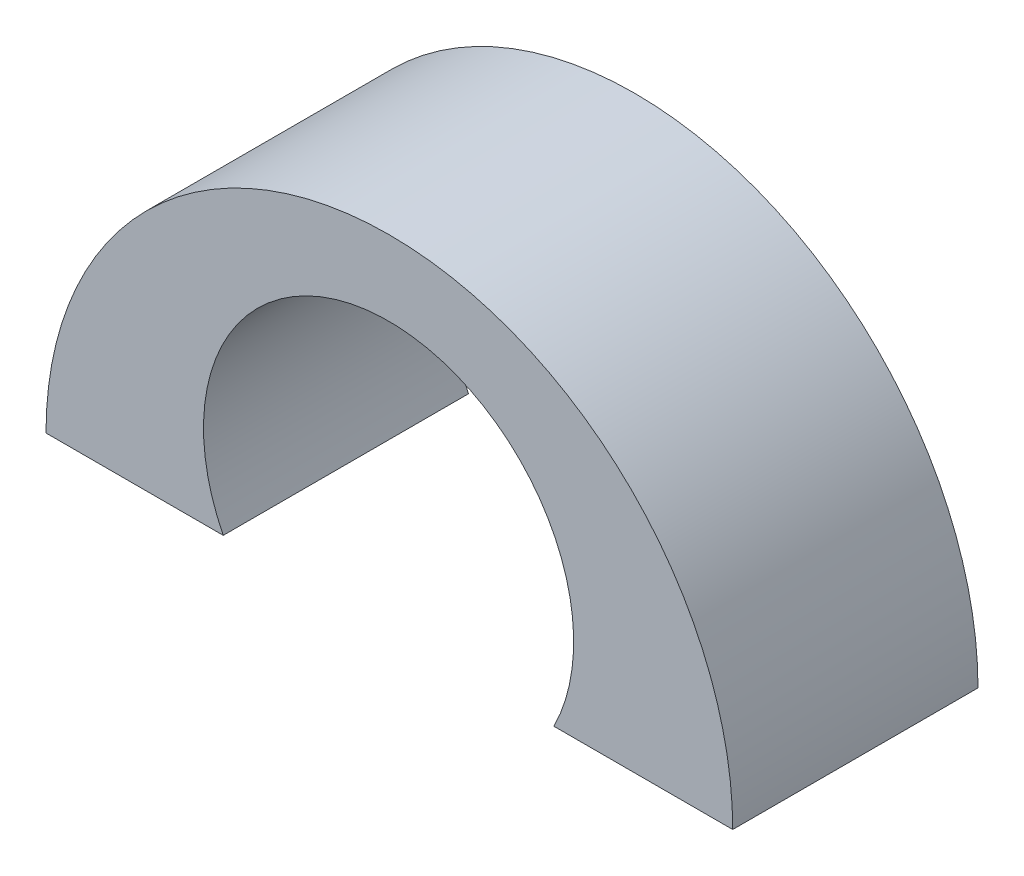
ISO-10303-21;
HEADER;
FILE_DESCRIPTION(('STEP AP214'),'2;1');
FILE_NAME('part.step','',(''),(''),'','','');
FILE_SCHEMA(('AUTOMOTIVE_DESIGN { 1 0 10303 214 1 1 1 1 }'));
ENDSEC;
DATA;
#1=APPLICATION_CONTEXT('core data for automotive mechanical design processes');
#2=APPLICATION_PROTOCOL_DEFINITION('international standard','automotive_design',2000,#1);
#3=PRODUCT_CONTEXT('',#1,'mechanical');
#4=PRODUCT('Part','Part','',(#3));
#5=PRODUCT_RELATED_PRODUCT_CATEGORY('part','',(#4));
#6=PRODUCT_DEFINITION_FORMATION('','',#4);
#7=PRODUCT_DEFINITION_CONTEXT('part definition',#1,'design');
#8=PRODUCT_DEFINITION('design','',#6,#7);
#9=PRODUCT_DEFINITION_SHAPE('','',#8);
#10=(LENGTH_UNIT() NAMED_UNIT(*) SI_UNIT(.MILLI.,.METRE.));
#11=(NAMED_UNIT(*) PLANE_ANGLE_UNIT() SI_UNIT($,.RADIAN.));
#12=(NAMED_UNIT(*) SI_UNIT($,.STERADIAN.) SOLID_ANGLE_UNIT());
#13=UNCERTAINTY_MEASURE_WITH_UNIT(LENGTH_MEASURE(1.E-05),#10,'distance_accuracy_value','');
#14=(GEOMETRIC_REPRESENTATION_CONTEXT(3) GLOBAL_UNCERTAINTY_ASSIGNED_CONTEXT((#13)) GLOBAL_UNIT_ASSIGNED_CONTEXT((#10,
#11,#12)) REPRESENTATION_CONTEXT('',''));
#15=CARTESIAN_POINT('',(0.,0.,0.));
#16=DIRECTION('',(0.,0.,1.));
#17=DIRECTION('',(1.,0.,0.));
#18=AXIS2_PLACEMENT_3D('',#15,#16,#17);
#19=CARTESIAN_POINT('',(0.,0.,5.));
#20=DIRECTION('',(0.,0.,-1.));
#21=DIRECTION('',(-1.,0.,0.));
#22=AXIS2_PLACEMENT_3D('',#19,#20,#21);
#23=CYLINDRICAL_SURFACE('',#22,7.);
#24=CARTESIAN_POINT('',(0.,0.,0.));
#25=DIRECTION('',(0.,0.,1.));
#26=DIRECTION('',(-1.,0.,0.));
#27=AXIS2_PLACEMENT_3D('',#24,#25,#26);
#28=CIRCLE('',#27,7.);
#29=CARTESIAN_POINT('',(7.,0.,0.));
#30=VERTEX_POINT('',#29);
#31=CARTESIAN_POINT('',(-7.,0.,0.));
#32=VERTEX_POINT('',#31);
#33=EDGE_CURVE('E96',#30,#32,#28,.T.);
#34=ORIENTED_EDGE('',*,*,#33,.T.);
#35=DIRECTION('',(0.,0.,-1.));
#36=VECTOR('',#35,1.);
#37=CARTESIAN_POINT('',(-7.,0.,5.));
#38=LINE('',#37,#36);
#39=CARTESIAN_POINT('',(-7.,0.,5.));
#40=VERTEX_POINT('',#39);
#41=EDGE_CURVE('E11',#40,#32,#38,.T.);
#42=ORIENTED_EDGE('',*,*,#41,.F.);
#43=CARTESIAN_POINT('',(0.,0.,5.));
#44=DIRECTION('',(0.,0.,1.));
#45=DIRECTION('',(-1.,0.,0.));
#46=AXIS2_PLACEMENT_3D('',#43,#44,#45);
#47=CIRCLE('',#46,7.);
#48=CARTESIAN_POINT('',(7.,0.,5.));
#49=VERTEX_POINT('',#48);
#50=EDGE_CURVE('E84',#49,#40,#47,.T.);
#51=ORIENTED_EDGE('',*,*,#50,.F.);
#52=DIRECTION('',(0.,0.,-1.));
#53=VECTOR('',#52,1.);
#54=CARTESIAN_POINT('',(7.,0.,5.));
#55=LINE('',#54,#53);
#56=EDGE_CURVE('E92',#49,#30,#55,.T.);
#57=ORIENTED_EDGE('',*,*,#56,.T.);
#58=EDGE_LOOP('',(#34,#42,#51,#57));
#59=FACE_BOUND('',#58,.T.);
#60=ADVANCED_FACE('F33',(#59),#23,.T.);
#61=CARTESIAN_POINT('',(-3.38648568331289,0.,5.));
#62=DIRECTION('',(0.,1.,0.));
#63=DIRECTION('',(-1.,0.,0.));
#64=AXIS2_PLACEMENT_3D('',#61,#62,#63);
#65=PLANE('',#64);
#66=DIRECTION('',(1.,0.,0.));
#67=VECTOR('',#66,1.);
#68=CARTESIAN_POINT('',(-3.38648568331289,0.,0.));
#69=LINE('',#68,#67);
#70=CARTESIAN_POINT('',(-3.38648568331289,0.,0.));
#71=VERTEX_POINT('',#70);
#72=EDGE_CURVE('E88',#32,#71,#69,.T.);
#73=ORIENTED_EDGE('',*,*,#72,.T.);
#74=DIRECTION('',(0.,0.,-1.));
#75=VECTOR('',#74,1.);
#76=CARTESIAN_POINT('',(-3.38648568331289,0.,5.));
#77=LINE('',#76,#75);
#78=CARTESIAN_POINT('',(-3.38648568331289,0.,5.));
#79=VERTEX_POINT('',#78);
#80=EDGE_CURVE('E41',#79,#71,#77,.T.);
#81=ORIENTED_EDGE('',*,*,#80,.F.);
#82=DIRECTION('',(1.,0.,0.));
#83=VECTOR('',#82,1.);
#84=CARTESIAN_POINT('',(-3.38648568331289,0.,5.));
#85=LINE('',#84,#83);
#86=EDGE_CURVE('E79',#40,#79,#85,.T.);
#87=ORIENTED_EDGE('',*,*,#86,.F.);
#88=ORIENTED_EDGE('',*,*,#41,.T.);
#89=EDGE_LOOP('',(#73,#81,#87,#88));
#90=FACE_BOUND('',#89,.T.);
#91=ADVANCED_FACE('F87',(#90),#65,.F.);
#92=CARTESIAN_POINT('',(-0.0160141943291048,1.69585177973782,5.));
#93=DIRECTION('',(0.,0.,-1.));
#94=DIRECTION('',(-1.,0.,0.));
#95=AXIS2_PLACEMENT_3D('',#92,#93,#94);
#96=CYLINDRICAL_SURFACE('',#95,3.77306126598714);
#97=CARTESIAN_POINT('',(-0.0160141943291048,1.69585177973782,0.));
#98=DIRECTION('',(0.,0.,-1.));
#99=DIRECTION('',(-1.,0.,0.));
#100=AXIS2_PLACEMENT_3D('',#97,#98,#99);
#101=CIRCLE('',#100,3.77306126598714);
#102=CARTESIAN_POINT('',(3.35445729465467,0.,0.));
#103=VERTEX_POINT('',#102);
#104=EDGE_CURVE('E66',#71,#103,#101,.T.);
#105=ORIENTED_EDGE('',*,*,#104,.T.);
#106=DIRECTION('',(0.,0.,-1.));
#107=VECTOR('',#106,1.);
#108=CARTESIAN_POINT('',(3.35445729465467,0.,5.));
#109=LINE('',#108,#107);
#110=CARTESIAN_POINT('',(3.35445729465467,0.,5.));
#111=VERTEX_POINT('',#110);
#112=EDGE_CURVE('E89',#111,#103,#109,.T.);
#113=ORIENTED_EDGE('',*,*,#112,.F.);
#114=CARTESIAN_POINT('',(-0.0160141943291048,1.69585177973782,5.));
#115=DIRECTION('',(0.,0.,-1.));
#116=DIRECTION('',(-1.,0.,0.));
#117=AXIS2_PLACEMENT_3D('',#114,#115,#116);
#118=CIRCLE('',#117,3.77306126598714);
#119=EDGE_CURVE('E82',#79,#111,#118,.T.);
#120=ORIENTED_EDGE('',*,*,#119,.F.);
#121=ORIENTED_EDGE('',*,*,#80,.T.);
#122=EDGE_LOOP('',(#105,#113,#120,#121));
#123=FACE_BOUND('',#122,.T.);
#124=ADVANCED_FACE('F90',(#123),#96,.F.);
#125=CARTESIAN_POINT('',(3.35445729465468,0.,5.));
#126=DIRECTION('',(0.,1.,0.));
#127=DIRECTION('',(0.,0.,1.));
#128=AXIS2_PLACEMENT_3D('',#125,#126,#127);
#129=PLANE('',#128);
#130=DIRECTION('',(1.,0.,0.));
#131=VECTOR('',#130,1.);
#132=CARTESIAN_POINT('',(3.35445729465468,0.,0.));
#133=LINE('',#132,#131);
#134=EDGE_CURVE('E72',#103,#30,#133,.T.);
#135=ORIENTED_EDGE('',*,*,#134,.T.);
#136=ORIENTED_EDGE('',*,*,#56,.F.);
#137=DIRECTION('',(1.,0.,0.));
#138=VECTOR('',#137,1.);
#139=CARTESIAN_POINT('',(3.35445729465468,0.,5.));
#140=LINE('',#139,#138);
#141=EDGE_CURVE('E49',#111,#49,#140,.T.);
#142=ORIENTED_EDGE('',*,*,#141,.F.);
#143=ORIENTED_EDGE('',*,*,#112,.T.);
#144=EDGE_LOOP('',(#135,#136,#142,#143));
#145=FACE_BOUND('',#144,.T.);
#146=ADVANCED_FACE('F103',(#145),#129,.F.);
#147=CARTESIAN_POINT('',(0.,0.,5.));
#148=DIRECTION('',(0.,0.,-1.));
#149=DIRECTION('',(-1.,0.,0.));
#150=AXIS2_PLACEMENT_3D('',#147,#148,#149);
#151=PLANE('',#150);
#152=ORIENTED_EDGE('',*,*,#50,.T.);
#153=ORIENTED_EDGE('',*,*,#86,.T.);
#154=ORIENTED_EDGE('',*,*,#119,.T.);
#155=ORIENTED_EDGE('',*,*,#141,.T.);
#156=EDGE_LOOP('',(#152,#153,#154,#155));
#157=FACE_BOUND('',#156,.T.);
#158=ADVANCED_FACE('F80',(#157),#151,.F.);
#159=CARTESIAN_POINT('',(0.,0.,0.));
#160=DIRECTION('',(0.,0.,-1.));
#161=DIRECTION('',(-1.,0.,0.));
#162=AXIS2_PLACEMENT_3D('',#159,#160,#161);
#163=PLANE('',#162);
#164=ORIENTED_EDGE('',*,*,#33,.F.);
#165=ORIENTED_EDGE('',*,*,#134,.F.);
#166=ORIENTED_EDGE('',*,*,#104,.F.);
#167=ORIENTED_EDGE('',*,*,#72,.F.);
#168=EDGE_LOOP('',(#164,#165,#166,#167));
#169=FACE_BOUND('',#168,.T.);
#170=ADVANCED_FACE('F106',(#169),#163,.T.);
#171=CLOSED_SHELL('',(#60,#91,#124,#146,#158,#170));
#172=MANIFOLD_SOLID_BREP('B2',#171);
#173=ADVANCED_BREP_SHAPE_REPRESENTATION('',(#18,#172),#14);
#174=SHAPE_DEFINITION_REPRESENTATION(#9,#173);
ENDSEC;
END-ISO-10303-21;
